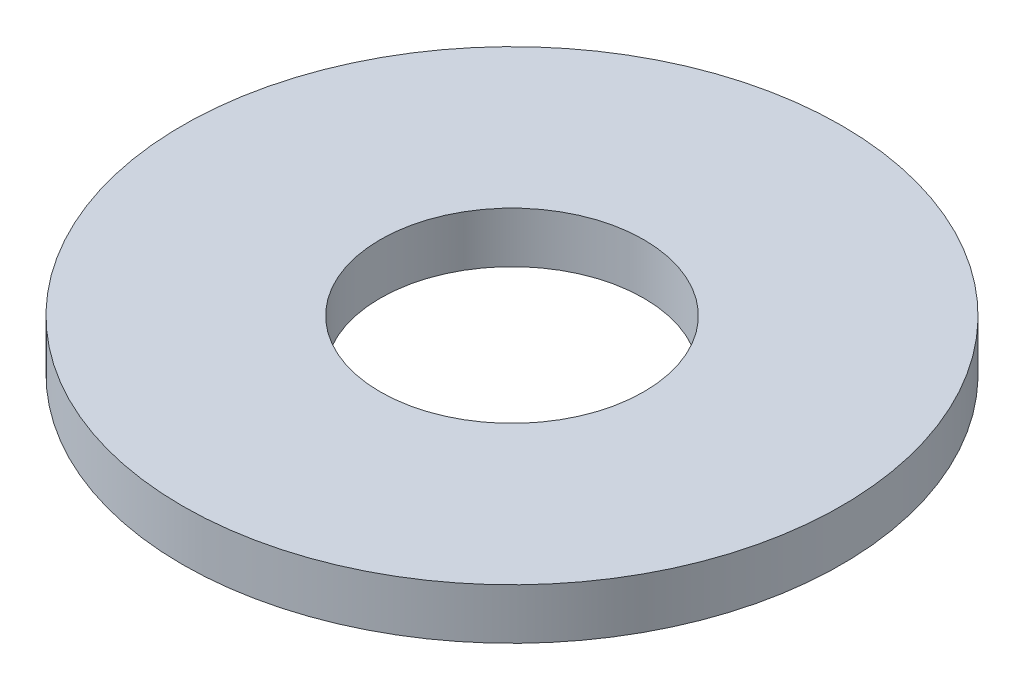
ISO-10303-21;
HEADER;
FILE_DESCRIPTION(('STEP AP214'),'2;1');
FILE_NAME('part.step','',(''),(''),'','','');
FILE_SCHEMA(('AUTOMOTIVE_DESIGN { 1 0 10303 214 1 1 1 1 }'));
ENDSEC;
DATA;
#1=APPLICATION_CONTEXT('core data for automotive mechanical design processes');
#2=APPLICATION_PROTOCOL_DEFINITION('international standard','automotive_design',2000,#1);
#3=PRODUCT_CONTEXT('',#1,'mechanical');
#4=PRODUCT('Part','Part','',(#3));
#5=PRODUCT_RELATED_PRODUCT_CATEGORY('part','',(#4));
#6=PRODUCT_DEFINITION_FORMATION('','',#4);
#7=PRODUCT_DEFINITION_CONTEXT('part definition',#1,'design');
#8=PRODUCT_DEFINITION('design','',#6,#7);
#9=PRODUCT_DEFINITION_SHAPE('','',#8);
#10=(LENGTH_UNIT() NAMED_UNIT(*) SI_UNIT(.MILLI.,.METRE.));
#11=(NAMED_UNIT(*) PLANE_ANGLE_UNIT() SI_UNIT($,.RADIAN.));
#12=(NAMED_UNIT(*) SI_UNIT($,.STERADIAN.) SOLID_ANGLE_UNIT());
#13=UNCERTAINTY_MEASURE_WITH_UNIT(LENGTH_MEASURE(1.E-05),#10,'distance_accuracy_value','');
#14=(GEOMETRIC_REPRESENTATION_CONTEXT(3) GLOBAL_UNCERTAINTY_ASSIGNED_CONTEXT((#13)) GLOBAL_UNIT_ASSIGNED_CONTEXT((#10,
#11,#12)) REPRESENTATION_CONTEXT('',''));
#15=CARTESIAN_POINT('',(0.,0.,0.));
#16=DIRECTION('',(0.,0.,1.));
#17=DIRECTION('',(1.,0.,0.));
#18=AXIS2_PLACEMENT_3D('',#15,#16,#17);
#19=CARTESIAN_POINT('',(0.,-0.8,0.));
#20=DIRECTION('',(0.,1.,0.));
#21=DIRECTION('',(0.,0.,1.));
#22=AXIS2_PLACEMENT_3D('',#19,#20,#21);
#23=CYLINDRICAL_SURFACE('',#22,3.9);
#24=CARTESIAN_POINT('',(0.,-0.8,0.));
#25=DIRECTION('',(0.,1.,0.));
#26=DIRECTION('',(0.,0.,1.));
#27=AXIS2_PLACEMENT_3D('',#24,#25,#26);
#28=CIRCLE('',#27,3.9);
#29=CARTESIAN_POINT('',(0.,-0.8,3.9));
#30=VERTEX_POINT('',#29);
#31=EDGE_CURVE('E45',#30,#30,#28,.T.);
#32=ORIENTED_EDGE('',*,*,#31,.T.);
#33=EDGE_LOOP('',(#32));
#34=FACE_BOUND('',#33,.T.);
#35=CARTESIAN_POINT('',(0.,-0.2,0.));
#36=DIRECTION('',(0.,1.,0.));
#37=DIRECTION('',(0.,0.,1.));
#38=AXIS2_PLACEMENT_3D('',#35,#36,#37);
#39=CIRCLE('',#38,3.9);
#40=CARTESIAN_POINT('',(0.,-0.2,3.9));
#41=VERTEX_POINT('',#40);
#42=EDGE_CURVE('E51',#41,#41,#39,.T.);
#43=ORIENTED_EDGE('',*,*,#42,.F.);
#44=EDGE_LOOP('',(#43));
#45=FACE_BOUND('',#44,.T.);
#46=ADVANCED_FACE('F38',(#34,#45),#23,.T.);
#47=CARTESIAN_POINT('',(0.,-0.8,0.));
#48=DIRECTION('',(0.,1.,0.));
#49=DIRECTION('',(0.,0.,1.));
#50=AXIS2_PLACEMENT_3D('',#47,#48,#49);
#51=CYLINDRICAL_SURFACE('',#50,1.56);
#52=CARTESIAN_POINT('',(0.,-0.8,0.));
#53=DIRECTION('',(0.,1.,0.));
#54=DIRECTION('',(0.,0.,1.));
#55=AXIS2_PLACEMENT_3D('',#52,#53,#54);
#56=CIRCLE('',#55,1.56);
#57=CARTESIAN_POINT('',(0.,-0.8,1.56));
#58=VERTEX_POINT('',#57);
#59=EDGE_CURVE('E10',#58,#58,#56,.T.);
#60=ORIENTED_EDGE('',*,*,#59,.F.);
#61=EDGE_LOOP('',(#60));
#62=FACE_BOUND('',#61,.T.);
#63=CARTESIAN_POINT('',(0.,-0.2,0.));
#64=DIRECTION('',(0.,1.,0.));
#65=DIRECTION('',(0.,0.,1.));
#66=AXIS2_PLACEMENT_3D('',#63,#64,#65);
#67=CIRCLE('',#66,1.56);
#68=CARTESIAN_POINT('',(0.,-0.2,1.56));
#69=VERTEX_POINT('',#68);
#70=EDGE_CURVE('E41',#69,#69,#67,.T.);
#71=ORIENTED_EDGE('',*,*,#70,.T.);
#72=EDGE_LOOP('',(#71));
#73=FACE_BOUND('',#72,.T.);
#74=ADVANCED_FACE('F58',(#62,#73),#51,.F.);
#75=CARTESIAN_POINT('',(0.,-0.8,0.));
#76=DIRECTION('',(0.,1.,0.));
#77=DIRECTION('',(0.,0.,1.));
#78=AXIS2_PLACEMENT_3D('',#75,#76,#77);
#79=PLANE('',#78);
#80=ORIENTED_EDGE('',*,*,#31,.F.);
#81=EDGE_LOOP('',(#80));
#82=FACE_BOUND('',#81,.T.);
#83=ORIENTED_EDGE('',*,*,#59,.T.);
#84=EDGE_LOOP('',(#83));
#85=FACE_BOUND('',#84,.T.);
#86=ADVANCED_FACE('F62',(#82,#85),#79,.F.);
#87=CARTESIAN_POINT('',(0.,-0.2,0.));
#88=DIRECTION('',(0.,1.,0.));
#89=DIRECTION('',(0.,0.,1.));
#90=AXIS2_PLACEMENT_3D('',#87,#88,#89);
#91=PLANE('',#90);
#92=ORIENTED_EDGE('',*,*,#42,.T.);
#93=EDGE_LOOP('',(#92));
#94=FACE_BOUND('',#93,.T.);
#95=ORIENTED_EDGE('',*,*,#70,.F.);
#96=EDGE_LOOP('',(#95));
#97=FACE_BOUND('',#96,.T.);
#98=ADVANCED_FACE('F60',(#94,#97),#91,.T.);
#99=CLOSED_SHELL('',(#46,#74,#86,#98));
#100=MANIFOLD_SOLID_BREP('B2',#99);
#101=ADVANCED_BREP_SHAPE_REPRESENTATION('',(#18,#100),#14);
#102=SHAPE_DEFINITION_REPRESENTATION(#9,#101);
ENDSEC;
END-ISO-10303-21;
